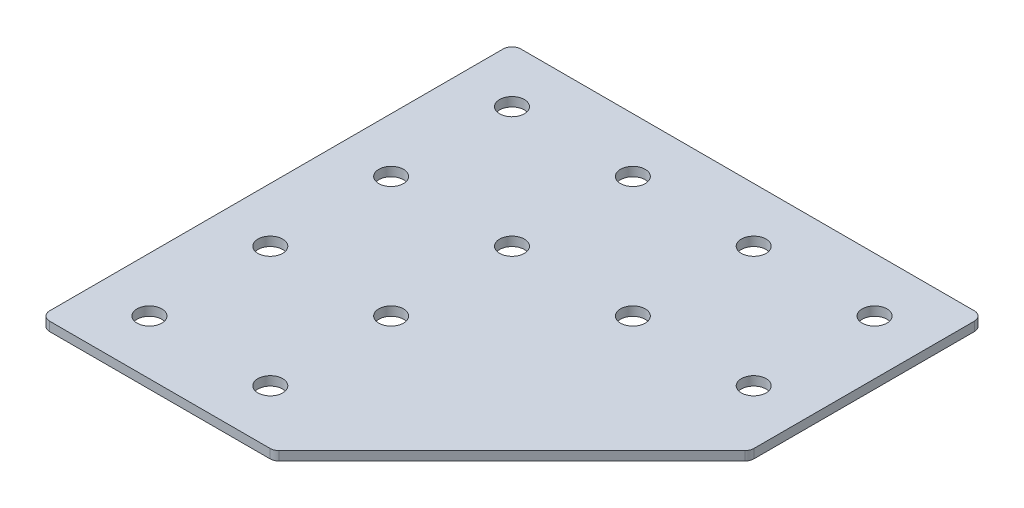
ISO-10303-21;
HEADER;
FILE_DESCRIPTION(('STEP AP214'),'2;1');
FILE_NAME('part.step','',(''),(''),'','','');
FILE_SCHEMA(('AUTOMOTIVE_DESIGN { 1 0 10303 214 1 1 1 1 }'));
ENDSEC;
DATA;
#1=APPLICATION_CONTEXT('core data for automotive mechanical design processes');
#2=APPLICATION_PROTOCOL_DEFINITION('international standard','automotive_design',2000,#1);
#3=PRODUCT_CONTEXT('',#1,'mechanical');
#4=PRODUCT('Part','Part','',(#3));
#5=PRODUCT_RELATED_PRODUCT_CATEGORY('part','',(#4));
#6=PRODUCT_DEFINITION_FORMATION('','',#4);
#7=PRODUCT_DEFINITION_CONTEXT('part definition',#1,'design');
#8=PRODUCT_DEFINITION('design','',#6,#7);
#9=PRODUCT_DEFINITION_SHAPE('','',#8);
#10=(LENGTH_UNIT() NAMED_UNIT(*) SI_UNIT(.MILLI.,.METRE.));
#11=(NAMED_UNIT(*) PLANE_ANGLE_UNIT() SI_UNIT($,.RADIAN.));
#12=(NAMED_UNIT(*) SI_UNIT($,.STERADIAN.) SOLID_ANGLE_UNIT());
#13=UNCERTAINTY_MEASURE_WITH_UNIT(LENGTH_MEASURE(1.E-05),#10,'distance_accuracy_value','');
#14=(GEOMETRIC_REPRESENTATION_CONTEXT(3) GLOBAL_UNCERTAINTY_ASSIGNED_CONTEXT((#13)) GLOBAL_UNIT_ASSIGNED_CONTEXT((#10,
#11,#12)) REPRESENTATION_CONTEXT('',''));
#15=CARTESIAN_POINT('',(0.,0.,0.));
#16=DIRECTION('',(0.,0.,1.));
#17=DIRECTION('',(1.,0.,0.));
#18=AXIS2_PLACEMENT_3D('',#15,#16,#17);
#19=CARTESIAN_POINT('',(-40.8616995423835,0.774709326684388,-41.412640110459));
#20=DIRECTION('',(0.,-1.,0.));
#21=DIRECTION('',(0.,0.,-1.));
#22=AXIS2_PLACEMENT_3D('',#19,#20,#21);
#23=PLANE('',#22);
#24=CARTESIAN_POINT('',(59.1383004576166,0.774709326684388,-21.412640110459));
#25=DIRECTION('',(0.,1.,0.));
#26=DIRECTION('',(0.,0.,1.));
#27=AXIS2_PLACEMENT_3D('',#24,#25,#26);
#28=CIRCLE('',#27,4.1);
#29=CARTESIAN_POINT('',(59.1383004576166,0.774709326684388,-17.312640110459));
#30=VERTEX_POINT('',#29);
#31=EDGE_CURVE('E275',#30,#30,#28,.T.);
#32=ORIENTED_EDGE('',*,*,#31,.T.);
#33=EDGE_LOOP('',(#32));
#34=FACE_BOUND('',#33,.T.);
#35=CARTESIAN_POINT('',(19.1383004576166,0.774709326684388,-21.412640110459));
#36=DIRECTION('',(0.,1.,0.));
#37=DIRECTION('',(0.,0.,1.));
#38=AXIS2_PLACEMENT_3D('',#35,#36,#37);
#39=CIRCLE('',#38,4.1);
#40=CARTESIAN_POINT('',(19.1383004576166,0.774709326684388,-17.312640110459));
#41=VERTEX_POINT('',#40);
#42=EDGE_CURVE('E283',#41,#41,#39,.T.);
#43=ORIENTED_EDGE('',*,*,#42,.T.);
#44=EDGE_LOOP('',(#43));
#45=FACE_BOUND('',#44,.T.);
#46=CARTESIAN_POINT('',(-20.8616995423835,0.774709326684388,58.587359889541));
#47=DIRECTION('',(0.,1.,0.));
#48=DIRECTION('',(0.,0.,1.));
#49=AXIS2_PLACEMENT_3D('',#46,#47,#48);
#50=CIRCLE('',#49,4.1);
#51=CARTESIAN_POINT('',(-20.8616995423835,0.774709326684388,62.687359889541));
#52=VERTEX_POINT('',#51);
#53=EDGE_CURVE('E289',#52,#52,#50,.T.);
#54=ORIENTED_EDGE('',*,*,#53,.T.);
#55=EDGE_LOOP('',(#54));
#56=FACE_BOUND('',#55,.T.);
#57=CARTESIAN_POINT('',(-60.8616995423835,0.774709326684388,58.587359889541));
#58=DIRECTION('',(0.,1.,0.));
#59=DIRECTION('',(0.,0.,1.));
#60=AXIS2_PLACEMENT_3D('',#57,#58,#59);
#61=CIRCLE('',#60,4.1);
#62=CARTESIAN_POINT('',(-60.8616995423835,0.774709326684388,62.687359889541));
#63=VERTEX_POINT('',#62);
#64=EDGE_CURVE('E295',#63,#63,#61,.T.);
#65=ORIENTED_EDGE('',*,*,#64,.T.);
#66=EDGE_LOOP('',(#65));
#67=FACE_BOUND('',#66,.T.);
#68=CARTESIAN_POINT('',(-20.8616995423835,0.774709326684388,18.587359889541));
#69=DIRECTION('',(0.,1.,0.));
#70=DIRECTION('',(0.,0.,1.));
#71=AXIS2_PLACEMENT_3D('',#68,#69,#70);
#72=CIRCLE('',#71,4.1);
#73=CARTESIAN_POINT('',(-20.8616995423835,0.774709326684388,22.687359889541));
#74=VERTEX_POINT('',#73);
#75=EDGE_CURVE('E301',#74,#74,#72,.T.);
#76=ORIENTED_EDGE('',*,*,#75,.T.);
#77=EDGE_LOOP('',(#76));
#78=FACE_BOUND('',#77,.T.);
#79=CARTESIAN_POINT('',(-60.8616995423835,0.774709326684388,18.587359889541));
#80=DIRECTION('',(0.,1.,0.));
#81=DIRECTION('',(0.,0.,1.));
#82=AXIS2_PLACEMENT_3D('',#79,#80,#81);
#83=CIRCLE('',#82,4.1);
#84=CARTESIAN_POINT('',(-60.8616995423835,0.774709326684388,22.687359889541));
#85=VERTEX_POINT('',#84);
#86=EDGE_CURVE('E307',#85,#85,#83,.T.);
#87=ORIENTED_EDGE('',*,*,#86,.T.);
#88=EDGE_LOOP('',(#87));
#89=FACE_BOUND('',#88,.T.);
#90=CARTESIAN_POINT('',(-20.8616995423835,0.774709326684388,-21.412640110459));
#91=DIRECTION('',(0.,1.,0.));
#92=DIRECTION('',(0.,0.,1.));
#93=AXIS2_PLACEMENT_3D('',#90,#91,#92);
#94=CIRCLE('',#93,4.1);
#95=CARTESIAN_POINT('',(-20.8616995423835,0.774709326684388,-17.312640110459));
#96=VERTEX_POINT('',#95);
#97=EDGE_CURVE('E313',#96,#96,#94,.T.);
#98=ORIENTED_EDGE('',*,*,#97,.T.);
#99=EDGE_LOOP('',(#98));
#100=FACE_BOUND('',#99,.T.);
#101=CARTESIAN_POINT('',(-60.8616995423835,0.774709326684388,-21.412640110459));
#102=DIRECTION('',(0.,1.,0.));
#103=DIRECTION('',(0.,0.,1.));
#104=AXIS2_PLACEMENT_3D('',#101,#102,#103);
#105=CIRCLE('',#104,4.1);
#106=CARTESIAN_POINT('',(-60.8616995423835,0.774709326684388,-17.312640110459));
#107=VERTEX_POINT('',#106);
#108=EDGE_CURVE('E319',#107,#107,#105,.T.);
#109=ORIENTED_EDGE('',*,*,#108,.T.);
#110=EDGE_LOOP('',(#109));
#111=FACE_BOUND('',#110,.T.);
#112=CARTESIAN_POINT('',(59.1383004576166,0.774709326684388,-61.412640110459));
#113=DIRECTION('',(0.,1.,0.));
#114=DIRECTION('',(0.,0.,1.));
#115=AXIS2_PLACEMENT_3D('',#112,#113,#114);
#116=CIRCLE('',#115,4.1);
#117=CARTESIAN_POINT('',(59.1383004576166,0.774709326684388,-57.312640110459));
#118=VERTEX_POINT('',#117);
#119=EDGE_CURVE('E325',#118,#118,#116,.T.);
#120=ORIENTED_EDGE('',*,*,#119,.T.);
#121=EDGE_LOOP('',(#120));
#122=FACE_BOUND('',#121,.T.);
#123=CARTESIAN_POINT('',(19.1383004576166,0.774709326684388,-61.412640110459));
#124=DIRECTION('',(0.,1.,0.));
#125=DIRECTION('',(0.,0.,1.));
#126=AXIS2_PLACEMENT_3D('',#123,#124,#125);
#127=CIRCLE('',#126,4.1);
#128=CARTESIAN_POINT('',(19.1383004576166,0.774709326684388,-57.312640110459));
#129=VERTEX_POINT('',#128);
#130=EDGE_CURVE('E331',#129,#129,#127,.T.);
#131=ORIENTED_EDGE('',*,*,#130,.T.);
#132=EDGE_LOOP('',(#131));
#133=FACE_BOUND('',#132,.T.);
#134=CARTESIAN_POINT('',(-20.8616995423835,0.774709326684388,-61.412640110459));
#135=DIRECTION('',(0.,1.,0.));
#136=DIRECTION('',(0.,0.,1.));
#137=AXIS2_PLACEMENT_3D('',#134,#135,#136);
#138=CIRCLE('',#137,4.1);
#139=CARTESIAN_POINT('',(-20.8616995423835,0.774709326684388,-57.312640110459));
#140=VERTEX_POINT('',#139);
#141=EDGE_CURVE('E337',#140,#140,#138,.T.);
#142=ORIENTED_EDGE('',*,*,#141,.T.);
#143=EDGE_LOOP('',(#142));
#144=FACE_BOUND('',#143,.T.);
#145=CARTESIAN_POINT('',(-60.8616995423835,0.774709326684388,-61.412640110459));
#146=DIRECTION('',(0.,1.,0.));
#147=DIRECTION('',(0.,0.,1.));
#148=AXIS2_PLACEMENT_3D('',#145,#146,#147);
#149=CIRCLE('',#148,4.1);
#150=CARTESIAN_POINT('',(-60.8616995423835,0.774709326684388,-57.312640110459));
#151=VERTEX_POINT('',#150);
#152=EDGE_CURVE('E175',#151,#151,#149,.T.);
#153=ORIENTED_EDGE('',*,*,#152,.T.);
#154=EDGE_LOOP('',(#153));
#155=FACE_BOUND('',#154,.T.);
#156=DIRECTION('',(1.,0.,0.));
#157=VECTOR('',#156,1.);
#158=CARTESIAN_POINT('',(-78.8616995423836,0.774709326684388,76.587359889541));
#159=LINE('',#158,#157);
#160=CARTESIAN_POINT('',(-75.8616995423836,0.774709326684388,76.587359889541));
#161=VERTEX_POINT('',#160);
#162=CARTESIAN_POINT('',(-2.93276735424881,0.774709326684388,76.5873598895409));
#163=VERTEX_POINT('',#162);
#164=EDGE_CURVE('E121',#161,#163,#159,.T.);
#165=ORIENTED_EDGE('',*,*,#164,.F.);
#166=CARTESIAN_POINT('',(-75.8616995423836,0.774709326684388,73.587359889541));
#167=DIRECTION('',(0.,-1.,0.));
#168=DIRECTION('',(0.,0.,-1.));
#169=AXIS2_PLACEMENT_3D('',#166,#167,#168);
#170=CIRCLE('',#169,3.);
#171=CARTESIAN_POINT('',(-78.8616995423836,0.774709326684388,73.587359889541));
#172=VERTEX_POINT('',#171);
#173=EDGE_CURVE('E145',#161,#172,#170,.T.);
#174=ORIENTED_EDGE('',*,*,#173,.T.);
#175=DIRECTION('',(0.,0.,1.));
#176=VECTOR('',#175,1.);
#177=CARTESIAN_POINT('',(-78.8616995423836,0.774709326684388,-79.412640110459));
#178=LINE('',#177,#176);
#179=CARTESIAN_POINT('',(-78.8616995423836,0.774709326684388,-76.412640110459));
#180=VERTEX_POINT('',#179);
#181=EDGE_CURVE('E162',#180,#172,#178,.T.);
#182=ORIENTED_EDGE('',*,*,#181,.F.);
#183=CARTESIAN_POINT('',(-75.8616995423836,0.774709326684388,-76.412640110459));
#184=DIRECTION('',(0.,-1.,0.));
#185=DIRECTION('',(0.,0.,-1.));
#186=AXIS2_PLACEMENT_3D('',#183,#184,#185);
#187=CIRCLE('',#186,3.);
#188=CARTESIAN_POINT('',(-75.8616995423836,0.774709326684388,-79.412640110459));
#189=VERTEX_POINT('',#188);
#190=EDGE_CURVE('E117',#180,#189,#187,.T.);
#191=ORIENTED_EDGE('',*,*,#190,.T.);
#192=DIRECTION('',(-1.,0.,0.));
#193=VECTOR('',#192,1.);
#194=CARTESIAN_POINT('',(77.1383004576164,0.774709326684388,-79.4126401104591));
#195=LINE('',#194,#193);
#196=CARTESIAN_POINT('',(74.1383004576164,0.774709326684388,-79.4126401104591));
#197=VERTEX_POINT('',#196);
#198=EDGE_CURVE('E160',#197,#189,#195,.T.);
#199=ORIENTED_EDGE('',*,*,#198,.F.);
#200=CARTESIAN_POINT('',(74.1383004576164,0.774709326684388,-76.4126401104591));
#201=DIRECTION('',(0.,-1.,0.));
#202=DIRECTION('',(0.,0.,-1.));
#203=AXIS2_PLACEMENT_3D('',#200,#201,#202);
#204=CIRCLE('',#203,3.);
#205=CARTESIAN_POINT('',(77.1383004576164,0.774709326684388,-76.4126401104591));
#206=VERTEX_POINT('',#205);
#207=EDGE_CURVE('E140',#197,#206,#204,.T.);
#208=ORIENTED_EDGE('',*,*,#207,.T.);
#209=DIRECTION('',(0.,0.,-1.));
#210=VECTOR('',#209,1.);
#211=CARTESIAN_POINT('',(77.1383004576164,0.774709326684388,-2.24106723520513));
#212=LINE('',#211,#210);
#213=CARTESIAN_POINT('',(77.1383004576164,0.774709326684388,-3.48370792232441));
#214=VERTEX_POINT('',#213);
#215=EDGE_CURVE('E163',#214,#206,#212,.T.);
#216=ORIENTED_EDGE('',*,*,#215,.F.);
#217=CARTESIAN_POINT('',(74.1383004576164,0.774709326684388,-3.48370792232441));
#218=DIRECTION('',(0.,-1.,0.));
#219=DIRECTION('',(0.,0.,-1.));
#220=AXIS2_PLACEMENT_3D('',#217,#218,#219);
#221=CIRCLE('',#220,3.);
#222=CARTESIAN_POINT('',(76.2596208011761,0.774709326684388,-1.36238757876479));
#223=VERTEX_POINT('',#222);
#224=EDGE_CURVE('E31',#214,#223,#221,.T.);
#225=ORIENTED_EDGE('',*,*,#224,.T.);
#226=DIRECTION('',(0.707106781186547,0.,-0.707106781186548));
#227=VECTOR('',#226,1.);
#228=CARTESIAN_POINT('',(-1.69012666712953,0.774709326684388,76.5873598895409));
#229=LINE('',#228,#227);
#230=CARTESIAN_POINT('',(-0.811447010689172,0.774709326684388,75.7086802331006));
#231=VERTEX_POINT('',#230);
#232=EDGE_CURVE('E118',#231,#223,#229,.T.);
#233=ORIENTED_EDGE('',*,*,#232,.F.);
#234=CARTESIAN_POINT('',(-2.93276735424881,0.774709326684388,73.5873598895409));
#235=DIRECTION('',(0.,-1.,0.));
#236=DIRECTION('',(0.,0.,-1.));
#237=AXIS2_PLACEMENT_3D('',#234,#235,#236);
#238=CIRCLE('',#237,3.);
#239=EDGE_CURVE('E143',#231,#163,#238,.T.);
#240=ORIENTED_EDGE('',*,*,#239,.T.);
#241=EDGE_LOOP('',(#165,#174,#182,#191,#199,#208,#216,#225,#233,#240));
#242=FACE_BOUND('',#241,.T.);
#243=ADVANCED_FACE('F16',(#34,#45,#56,#67,#78,#89,#100,#111,#122,#133,#144,#155,#242),#23,.T.);
#244=CARTESIAN_POINT('',(77.1383004576164,0.774709326684388,-2.24106723520513));
#245=DIRECTION('',(1.,0.,0.));
#246=DIRECTION('',(0.,0.,-1.));
#247=AXIS2_PLACEMENT_3D('',#244,#245,#246);
#248=PLANE('',#247);
#249=DIRECTION('',(0.,0.,-1.));
#250=VECTOR('',#249,1.);
#251=CARTESIAN_POINT('',(77.1383004576164,3.77470932668439,-2.24106723520513));
#252=LINE('',#251,#250);
#253=CARTESIAN_POINT('',(77.1383004576164,3.77470932668439,-3.48370792232441));
#254=VERTEX_POINT('',#253);
#255=CARTESIAN_POINT('',(77.1383004576164,3.77470932668439,-76.4126401104591));
#256=VERTEX_POINT('',#255);
#257=EDGE_CURVE('E172',#254,#256,#252,.T.);
#258=ORIENTED_EDGE('',*,*,#257,.F.);
#259=DIRECTION('',(0.,1.,0.));
#260=VECTOR('',#259,1.);
#261=CARTESIAN_POINT('',(77.1383004576164,0.774709326684388,-3.48370792232441));
#262=LINE('',#261,#260);
#263=EDGE_CURVE('E154',#254,#214,#262,.F.);
#264=ORIENTED_EDGE('',*,*,#263,.T.);
#265=ORIENTED_EDGE('',*,*,#215,.T.);
#266=DIRECTION('',(0.,1.,0.));
#267=VECTOR('',#266,1.);
#268=CARTESIAN_POINT('',(77.1383004576164,0.774709326684388,-76.4126401104591));
#269=LINE('',#268,#267);
#270=EDGE_CURVE('E151',#206,#256,#269,.T.);
#271=ORIENTED_EDGE('',*,*,#270,.T.);
#272=EDGE_LOOP('',(#258,#264,#265,#271));
#273=FACE_BOUND('',#272,.T.);
#274=ADVANCED_FACE('F206',(#273),#248,.T.);
#275=CARTESIAN_POINT('',(-1.69012666712953,0.774709326684388,76.5873598895409));
#276=DIRECTION('',(0.707106781186548,0.,0.707106781186547));
#277=DIRECTION('',(0.707106781186547,0.,-0.707106781186548));
#278=AXIS2_PLACEMENT_3D('',#275,#276,#277);
#279=PLANE('',#278);
#280=DIRECTION('',(0.707106781186547,0.,-0.707106781186548));
#281=VECTOR('',#280,1.);
#282=CARTESIAN_POINT('',(-1.69012666712953,3.77470932668439,76.5873598895409));
#283=LINE('',#282,#281);
#284=CARTESIAN_POINT('',(-0.811447010689172,3.77470932668439,75.7086802331006));
#285=VERTEX_POINT('',#284);
#286=CARTESIAN_POINT('',(76.2596208011761,3.77470932668439,-1.36238757876479));
#287=VERTEX_POINT('',#286);
#288=EDGE_CURVE('E124',#285,#287,#283,.T.);
#289=ORIENTED_EDGE('',*,*,#288,.F.);
#290=DIRECTION('',(0.,1.,0.));
#291=VECTOR('',#290,1.);
#292=CARTESIAN_POINT('',(-0.811447010689172,0.774709326684388,75.7086802331006));
#293=LINE('',#292,#291);
#294=EDGE_CURVE('E38',#285,#231,#293,.F.);
#295=ORIENTED_EDGE('',*,*,#294,.T.);
#296=ORIENTED_EDGE('',*,*,#232,.T.);
#297=DIRECTION('',(0.,1.,0.));
#298=VECTOR('',#297,1.);
#299=CARTESIAN_POINT('',(76.2596208011761,0.774709326684388,-1.36238757876479));
#300=LINE('',#299,#298);
#301=EDGE_CURVE('E147',#223,#287,#300,.T.);
#302=ORIENTED_EDGE('',*,*,#301,.T.);
#303=EDGE_LOOP('',(#289,#295,#296,#302));
#304=FACE_BOUND('',#303,.T.);
#305=ADVANCED_FACE('F180',(#304),#279,.T.);
#306=CARTESIAN_POINT('',(-78.8616995423836,0.774709326684388,76.587359889541));
#307=DIRECTION('',(0.,0.,1.));
#308=DIRECTION('',(1.,0.,0.));
#309=AXIS2_PLACEMENT_3D('',#306,#307,#308);
#310=PLANE('',#309);
#311=DIRECTION('',(1.,0.,0.));
#312=VECTOR('',#311,1.);
#313=CARTESIAN_POINT('',(-78.8616995423836,3.77470932668439,76.587359889541));
#314=LINE('',#313,#312);
#315=CARTESIAN_POINT('',(-75.8616995423836,3.77470932668439,76.587359889541));
#316=VERTEX_POINT('',#315);
#317=CARTESIAN_POINT('',(-2.93276735424881,3.77470932668439,76.5873598895409));
#318=VERTEX_POINT('',#317);
#319=EDGE_CURVE('E114',#316,#318,#314,.T.);
#320=ORIENTED_EDGE('',*,*,#319,.F.);
#321=DIRECTION('',(0.,1.,0.));
#322=VECTOR('',#321,1.);
#323=CARTESIAN_POINT('',(-75.8616995423836,0.774709326684388,76.587359889541));
#324=LINE('',#323,#322);
#325=EDGE_CURVE('E137',#316,#161,#324,.F.);
#326=ORIENTED_EDGE('',*,*,#325,.T.);
#327=ORIENTED_EDGE('',*,*,#164,.T.);
#328=DIRECTION('',(0.,1.,0.));
#329=VECTOR('',#328,1.);
#330=CARTESIAN_POINT('',(-2.93276735424881,0.774709326684388,76.5873598895409));
#331=LINE('',#330,#329);
#332=EDGE_CURVE('E134',#163,#318,#331,.T.);
#333=ORIENTED_EDGE('',*,*,#332,.T.);
#334=EDGE_LOOP('',(#320,#326,#327,#333));
#335=FACE_BOUND('',#334,.T.);
#336=ADVANCED_FACE('F189',(#335),#310,.T.);
#337=CARTESIAN_POINT('',(-78.8616995423836,0.774709326684388,-79.412640110459));
#338=DIRECTION('',(-1.,0.,0.));
#339=DIRECTION('',(0.,0.,1.));
#340=AXIS2_PLACEMENT_3D('',#337,#338,#339);
#341=PLANE('',#340);
#342=ORIENTED_EDGE('',*,*,#181,.T.);
#343=DIRECTION('',(0.,1.,0.));
#344=VECTOR('',#343,1.);
#345=CARTESIAN_POINT('',(-78.8616995423836,0.774709326684388,73.587359889541));
#346=LINE('',#345,#344);
#347=CARTESIAN_POINT('',(-78.8616995423836,3.77470932668439,73.587359889541));
#348=VERTEX_POINT('',#347);
#349=EDGE_CURVE('E105',#172,#348,#346,.T.);
#350=ORIENTED_EDGE('',*,*,#349,.T.);
#351=DIRECTION('',(0.,0.,1.));
#352=VECTOR('',#351,1.);
#353=CARTESIAN_POINT('',(-78.8616995423836,3.77470932668439,-79.412640110459));
#354=LINE('',#353,#352);
#355=CARTESIAN_POINT('',(-78.8616995423836,3.77470932668439,-76.412640110459));
#356=VERTEX_POINT('',#355);
#357=EDGE_CURVE('E97',#356,#348,#354,.T.);
#358=ORIENTED_EDGE('',*,*,#357,.F.);
#359=DIRECTION('',(0.,1.,0.));
#360=VECTOR('',#359,1.);
#361=CARTESIAN_POINT('',(-78.8616995423836,0.774709326684388,-76.412640110459));
#362=LINE('',#361,#360);
#363=EDGE_CURVE('E111',#356,#180,#362,.F.);
#364=ORIENTED_EDGE('',*,*,#363,.T.);
#365=EDGE_LOOP('',(#342,#350,#358,#364));
#366=FACE_BOUND('',#365,.T.);
#367=ADVANCED_FACE('F110',(#366),#341,.T.);
#368=CARTESIAN_POINT('',(77.1383004576164,0.774709326684388,-79.4126401104591));
#369=DIRECTION('',(0.,0.,-1.));
#370=DIRECTION('',(-1.,0.,0.));
#371=AXIS2_PLACEMENT_3D('',#368,#369,#370);
#372=PLANE('',#371);
#373=DIRECTION('',(-1.,0.,0.));
#374=VECTOR('',#373,1.);
#375=CARTESIAN_POINT('',(77.1383004576164,3.77470932668439,-79.4126401104591));
#376=LINE('',#375,#374);
#377=CARTESIAN_POINT('',(74.1383004576164,3.77470932668439,-79.4126401104591));
#378=VERTEX_POINT('',#377);
#379=CARTESIAN_POINT('',(-75.8616995423836,3.77470932668439,-79.412640110459));
#380=VERTEX_POINT('',#379);
#381=EDGE_CURVE('E99',#378,#380,#376,.T.);
#382=ORIENTED_EDGE('',*,*,#381,.F.);
#383=DIRECTION('',(0.,1.,0.));
#384=VECTOR('',#383,1.);
#385=CARTESIAN_POINT('',(74.1383004576164,0.774709326684388,-79.4126401104591));
#386=LINE('',#385,#384);
#387=EDGE_CURVE('E10',#378,#197,#386,.F.);
#388=ORIENTED_EDGE('',*,*,#387,.T.);
#389=ORIENTED_EDGE('',*,*,#198,.T.);
#390=DIRECTION('',(0.,1.,0.));
#391=VECTOR('',#390,1.);
#392=CARTESIAN_POINT('',(-75.8616995423836,0.774709326684388,-79.412640110459));
#393=LINE('',#392,#391);
#394=EDGE_CURVE('E24',#189,#380,#393,.T.);
#395=ORIENTED_EDGE('',*,*,#394,.T.);
#396=EDGE_LOOP('',(#382,#388,#389,#395));
#397=FACE_BOUND('',#396,.T.);
#398=ADVANCED_FACE('F157',(#397),#372,.T.);
#399=CARTESIAN_POINT('',(-40.8616995423835,3.77470932668439,-41.412640110459));
#400=DIRECTION('',(0.,-1.,0.));
#401=DIRECTION('',(0.,0.,-1.));
#402=AXIS2_PLACEMENT_3D('',#399,#400,#401);
#403=PLANE('',#402);
#404=CARTESIAN_POINT('',(59.1383004576166,3.77470932668439,-21.412640110459));
#405=DIRECTION('',(0.,1.,0.));
#406=DIRECTION('',(0.,0.,1.));
#407=AXIS2_PLACEMENT_3D('',#404,#405,#406);
#408=CIRCLE('',#407,4.1);
#409=CARTESIAN_POINT('',(59.1383004576166,3.77470932668439,-17.312640110459));
#410=VERTEX_POINT('',#409);
#411=EDGE_CURVE('E278',#410,#410,#408,.T.);
#412=ORIENTED_EDGE('',*,*,#411,.F.);
#413=EDGE_LOOP('',(#412));
#414=FACE_BOUND('',#413,.T.);
#415=CARTESIAN_POINT('',(19.1383004576166,3.77470932668439,-21.412640110459));
#416=DIRECTION('',(0.,1.,0.));
#417=DIRECTION('',(0.,0.,1.));
#418=AXIS2_PLACEMENT_3D('',#415,#416,#417);
#419=CIRCLE('',#418,4.1);
#420=CARTESIAN_POINT('',(19.1383004576166,3.77470932668439,-17.312640110459));
#421=VERTEX_POINT('',#420);
#422=EDGE_CURVE('E280',#421,#421,#419,.T.);
#423=ORIENTED_EDGE('',*,*,#422,.F.);
#424=EDGE_LOOP('',(#423));
#425=FACE_BOUND('',#424,.T.);
#426=CARTESIAN_POINT('',(-20.8616995423835,3.77470932668439,58.587359889541));
#427=DIRECTION('',(0.,1.,0.));
#428=DIRECTION('',(0.,0.,1.));
#429=AXIS2_PLACEMENT_3D('',#426,#427,#428);
#430=CIRCLE('',#429,4.1);
#431=CARTESIAN_POINT('',(-20.8616995423835,3.77470932668439,62.687359889541));
#432=VERTEX_POINT('',#431);
#433=EDGE_CURVE('E286',#432,#432,#430,.T.);
#434=ORIENTED_EDGE('',*,*,#433,.F.);
#435=EDGE_LOOP('',(#434));
#436=FACE_BOUND('',#435,.T.);
#437=CARTESIAN_POINT('',(-60.8616995423835,3.77470932668439,58.587359889541));
#438=DIRECTION('',(0.,1.,0.));
#439=DIRECTION('',(0.,0.,1.));
#440=AXIS2_PLACEMENT_3D('',#437,#438,#439);
#441=CIRCLE('',#440,4.1);
#442=CARTESIAN_POINT('',(-60.8616995423835,3.77470932668439,62.687359889541));
#443=VERTEX_POINT('',#442);
#444=EDGE_CURVE('E292',#443,#443,#441,.T.);
#445=ORIENTED_EDGE('',*,*,#444,.F.);
#446=EDGE_LOOP('',(#445));
#447=FACE_BOUND('',#446,.T.);
#448=CARTESIAN_POINT('',(-20.8616995423835,3.77470932668439,18.587359889541));
#449=DIRECTION('',(0.,1.,0.));
#450=DIRECTION('',(0.,0.,1.));
#451=AXIS2_PLACEMENT_3D('',#448,#449,#450);
#452=CIRCLE('',#451,4.1);
#453=CARTESIAN_POINT('',(-20.8616995423835,3.77470932668439,22.687359889541));
#454=VERTEX_POINT('',#453);
#455=EDGE_CURVE('E298',#454,#454,#452,.T.);
#456=ORIENTED_EDGE('',*,*,#455,.F.);
#457=EDGE_LOOP('',(#456));
#458=FACE_BOUND('',#457,.T.);
#459=CARTESIAN_POINT('',(-60.8616995423835,3.77470932668439,18.587359889541));
#460=DIRECTION('',(0.,1.,0.));
#461=DIRECTION('',(0.,0.,1.));
#462=AXIS2_PLACEMENT_3D('',#459,#460,#461);
#463=CIRCLE('',#462,4.1);
#464=CARTESIAN_POINT('',(-60.8616995423835,3.77470932668439,22.687359889541));
#465=VERTEX_POINT('',#464);
#466=EDGE_CURVE('E304',#465,#465,#463,.T.);
#467=ORIENTED_EDGE('',*,*,#466,.F.);
#468=EDGE_LOOP('',(#467));
#469=FACE_BOUND('',#468,.T.);
#470=CARTESIAN_POINT('',(-20.8616995423835,3.77470932668439,-21.412640110459));
#471=DIRECTION('',(0.,1.,0.));
#472=DIRECTION('',(0.,0.,1.));
#473=AXIS2_PLACEMENT_3D('',#470,#471,#472);
#474=CIRCLE('',#473,4.1);
#475=CARTESIAN_POINT('',(-20.8616995423835,3.77470932668439,-17.312640110459));
#476=VERTEX_POINT('',#475);
#477=EDGE_CURVE('E310',#476,#476,#474,.T.);
#478=ORIENTED_EDGE('',*,*,#477,.F.);
#479=EDGE_LOOP('',(#478));
#480=FACE_BOUND('',#479,.T.);
#481=CARTESIAN_POINT('',(-60.8616995423835,3.77470932668439,-21.412640110459));
#482=DIRECTION('',(0.,1.,0.));
#483=DIRECTION('',(0.,0.,1.));
#484=AXIS2_PLACEMENT_3D('',#481,#482,#483);
#485=CIRCLE('',#484,4.1);
#486=CARTESIAN_POINT('',(-60.8616995423835,3.77470932668439,-17.312640110459));
#487=VERTEX_POINT('',#486);
#488=EDGE_CURVE('E316',#487,#487,#485,.T.);
#489=ORIENTED_EDGE('',*,*,#488,.F.);
#490=EDGE_LOOP('',(#489));
#491=FACE_BOUND('',#490,.T.);
#492=CARTESIAN_POINT('',(59.1383004576166,3.77470932668439,-61.412640110459));
#493=DIRECTION('',(0.,1.,0.));
#494=DIRECTION('',(0.,0.,1.));
#495=AXIS2_PLACEMENT_3D('',#492,#493,#494);
#496=CIRCLE('',#495,4.1);
#497=CARTESIAN_POINT('',(59.1383004576166,3.77470932668439,-57.312640110459));
#498=VERTEX_POINT('',#497);
#499=EDGE_CURVE('E322',#498,#498,#496,.T.);
#500=ORIENTED_EDGE('',*,*,#499,.F.);
#501=EDGE_LOOP('',(#500));
#502=FACE_BOUND('',#501,.T.);
#503=CARTESIAN_POINT('',(19.1383004576166,3.77470932668439,-61.412640110459));
#504=DIRECTION('',(0.,1.,0.));
#505=DIRECTION('',(0.,0.,1.));
#506=AXIS2_PLACEMENT_3D('',#503,#504,#505);
#507=CIRCLE('',#506,4.1);
#508=CARTESIAN_POINT('',(19.1383004576166,3.77470932668439,-57.312640110459));
#509=VERTEX_POINT('',#508);
#510=EDGE_CURVE('E328',#509,#509,#507,.T.);
#511=ORIENTED_EDGE('',*,*,#510,.F.);
#512=EDGE_LOOP('',(#511));
#513=FACE_BOUND('',#512,.T.);
#514=CARTESIAN_POINT('',(-20.8616995423835,3.77470932668439,-61.412640110459));
#515=DIRECTION('',(0.,1.,0.));
#516=DIRECTION('',(0.,0.,1.));
#517=AXIS2_PLACEMENT_3D('',#514,#515,#516);
#518=CIRCLE('',#517,4.1);
#519=CARTESIAN_POINT('',(-20.8616995423835,3.77470932668439,-57.312640110459));
#520=VERTEX_POINT('',#519);
#521=EDGE_CURVE('E334',#520,#520,#518,.T.);
#522=ORIENTED_EDGE('',*,*,#521,.F.);
#523=EDGE_LOOP('',(#522));
#524=FACE_BOUND('',#523,.T.);
#525=CARTESIAN_POINT('',(-60.8616995423835,3.77470932668439,-61.412640110459));
#526=DIRECTION('',(0.,1.,0.));
#527=DIRECTION('',(0.,0.,1.));
#528=AXIS2_PLACEMENT_3D('',#525,#526,#527);
#529=CIRCLE('',#528,4.1);
#530=CARTESIAN_POINT('',(-60.8616995423835,3.77470932668439,-57.312640110459));
#531=VERTEX_POINT('',#530);
#532=EDGE_CURVE('E340',#531,#531,#529,.T.);
#533=ORIENTED_EDGE('',*,*,#532,.F.);
#534=EDGE_LOOP('',(#533));
#535=FACE_BOUND('',#534,.T.);
#536=ORIENTED_EDGE('',*,*,#357,.T.);
#537=CARTESIAN_POINT('',(-75.8616995423836,3.77470932668439,73.587359889541));
#538=DIRECTION('',(0.,-1.,0.));
#539=DIRECTION('',(0.,0.,-1.));
#540=AXIS2_PLACEMENT_3D('',#537,#538,#539);
#541=CIRCLE('',#540,3.);
#542=EDGE_CURVE('E132',#348,#316,#541,.F.);
#543=ORIENTED_EDGE('',*,*,#542,.T.);
#544=ORIENTED_EDGE('',*,*,#319,.T.);
#545=CARTESIAN_POINT('',(-2.93276735424881,3.77470932668439,73.5873598895409));
#546=DIRECTION('',(0.,-1.,0.));
#547=DIRECTION('',(0.,0.,-1.));
#548=AXIS2_PLACEMENT_3D('',#545,#546,#547);
#549=CIRCLE('',#548,3.);
#550=EDGE_CURVE('E130',#318,#285,#549,.F.);
#551=ORIENTED_EDGE('',*,*,#550,.T.);
#552=ORIENTED_EDGE('',*,*,#288,.T.);
#553=CARTESIAN_POINT('',(74.1383004576164,3.77470932668439,-3.48370792232441));
#554=DIRECTION('',(0.,-1.,0.));
#555=DIRECTION('',(0.,0.,-1.));
#556=AXIS2_PLACEMENT_3D('',#553,#554,#555);
#557=CIRCLE('',#556,3.);
#558=EDGE_CURVE('E128',#287,#254,#557,.F.);
#559=ORIENTED_EDGE('',*,*,#558,.T.);
#560=ORIENTED_EDGE('',*,*,#257,.T.);
#561=CARTESIAN_POINT('',(74.1383004576164,3.77470932668439,-76.4126401104591));
#562=DIRECTION('',(0.,-1.,0.));
#563=DIRECTION('',(0.,0.,-1.));
#564=AXIS2_PLACEMENT_3D('',#561,#562,#563);
#565=CIRCLE('',#564,3.);
#566=EDGE_CURVE('E104',#256,#378,#565,.F.);
#567=ORIENTED_EDGE('',*,*,#566,.T.);
#568=ORIENTED_EDGE('',*,*,#381,.T.);
#569=CARTESIAN_POINT('',(-75.8616995423836,3.77470932668439,-76.412640110459));
#570=DIRECTION('',(0.,-1.,0.));
#571=DIRECTION('',(0.,0.,-1.));
#572=AXIS2_PLACEMENT_3D('',#569,#570,#571);
#573=CIRCLE('',#572,3.);
#574=EDGE_CURVE('E94',#380,#356,#573,.F.);
#575=ORIENTED_EDGE('',*,*,#574,.T.);
#576=EDGE_LOOP('',(#536,#543,#544,#551,#552,#559,#560,#567,#568,#575));
#577=FACE_BOUND('',#576,.T.);
#578=ADVANCED_FACE('F96',(#414,#425,#436,#447,#458,#469,#480,#491,#502,#513,#524,#535,#577),
#403,.F.);
#579=CARTESIAN_POINT('',(-75.8616995423836,0.774709326684388,73.587359889541));
#580=DIRECTION('',(0.,1.,0.));
#581=DIRECTION('',(0.,0.,1.));
#582=AXIS2_PLACEMENT_3D('',#579,#580,#581);
#583=CYLINDRICAL_SURFACE('',#582,3.);
#584=ORIENTED_EDGE('',*,*,#173,.F.);
#585=ORIENTED_EDGE('',*,*,#325,.F.);
#586=ORIENTED_EDGE('',*,*,#542,.F.);
#587=ORIENTED_EDGE('',*,*,#349,.F.);
#588=EDGE_LOOP('',(#584,#585,#586,#587));
#589=FACE_BOUND('',#588,.T.);
#590=ADVANCED_FACE('F192',(#589),#583,.T.);
#591=CARTESIAN_POINT('',(-2.93276735424881,0.774709326684388,73.5873598895409));
#592=DIRECTION('',(0.,1.,0.));
#593=DIRECTION('',(0.,0.,1.));
#594=AXIS2_PLACEMENT_3D('',#591,#592,#593);
#595=CYLINDRICAL_SURFACE('',#594,3.);
#596=ORIENTED_EDGE('',*,*,#239,.F.);
#597=ORIENTED_EDGE('',*,*,#294,.F.);
#598=ORIENTED_EDGE('',*,*,#550,.F.);
#599=ORIENTED_EDGE('',*,*,#332,.F.);
#600=EDGE_LOOP('',(#596,#597,#598,#599));
#601=FACE_BOUND('',#600,.T.);
#602=ADVANCED_FACE('F184',(#601),#595,.T.);
#603=CARTESIAN_POINT('',(74.1383004576164,0.774709326684388,-3.48370792232441));
#604=DIRECTION('',(0.,1.,0.));
#605=DIRECTION('',(0.,0.,1.));
#606=AXIS2_PLACEMENT_3D('',#603,#604,#605);
#607=CYLINDRICAL_SURFACE('',#606,3.);
#608=ORIENTED_EDGE('',*,*,#224,.F.);
#609=ORIENTED_EDGE('',*,*,#263,.F.);
#610=ORIENTED_EDGE('',*,*,#558,.F.);
#611=ORIENTED_EDGE('',*,*,#301,.F.);
#612=EDGE_LOOP('',(#608,#609,#610,#611));
#613=FACE_BOUND('',#612,.T.);
#614=ADVANCED_FACE('F200',(#613),#607,.T.);
#615=CARTESIAN_POINT('',(74.1383004576164,0.774709326684388,-76.4126401104591));
#616=DIRECTION('',(0.,1.,0.));
#617=DIRECTION('',(0.,0.,1.));
#618=AXIS2_PLACEMENT_3D('',#615,#616,#617);
#619=CYLINDRICAL_SURFACE('',#618,3.);
#620=ORIENTED_EDGE('',*,*,#207,.F.);
#621=ORIENTED_EDGE('',*,*,#387,.F.);
#622=ORIENTED_EDGE('',*,*,#566,.F.);
#623=ORIENTED_EDGE('',*,*,#270,.F.);
#624=EDGE_LOOP('',(#620,#621,#622,#623));
#625=FACE_BOUND('',#624,.T.);
#626=ADVANCED_FACE('F451',(#625),#619,.T.);
#627=CARTESIAN_POINT('',(-75.8616995423836,0.774709326684388,-76.412640110459));
#628=DIRECTION('',(0.,1.,0.));
#629=DIRECTION('',(0.,0.,1.));
#630=AXIS2_PLACEMENT_3D('',#627,#628,#629);
#631=CYLINDRICAL_SURFACE('',#630,3.);
#632=ORIENTED_EDGE('',*,*,#190,.F.);
#633=ORIENTED_EDGE('',*,*,#363,.F.);
#634=ORIENTED_EDGE('',*,*,#574,.F.);
#635=ORIENTED_EDGE('',*,*,#394,.F.);
#636=EDGE_LOOP('',(#632,#633,#634,#635));
#637=FACE_BOUND('',#636,.T.);
#638=ADVANCED_FACE('F18',(#637),#631,.T.);
#639=CARTESIAN_POINT('',(-60.8616995423835,0.774709326684388,-61.412640110459));
#640=DIRECTION('',(0.,1.,0.));
#641=DIRECTION('',(0.,0.,1.));
#642=AXIS2_PLACEMENT_3D('',#639,#640,#641);
#643=CYLINDRICAL_SURFACE('',#642,4.1);
#644=ORIENTED_EDGE('',*,*,#152,.F.);
#645=EDGE_LOOP('',(#644));
#646=FACE_BOUND('',#645,.T.);
#647=ORIENTED_EDGE('',*,*,#532,.T.);
#648=EDGE_LOOP('',(#647));
#649=FACE_BOUND('',#648,.T.);
#650=ADVANCED_FACE('F224',(#646,#649),#643,.F.);
#651=CARTESIAN_POINT('',(-20.8616995423835,0.774709326684388,-61.412640110459));
#652=DIRECTION('',(0.,1.,0.));
#653=DIRECTION('',(0.,0.,1.));
#654=AXIS2_PLACEMENT_3D('',#651,#652,#653);
#655=CYLINDRICAL_SURFACE('',#654,4.1);
#656=ORIENTED_EDGE('',*,*,#141,.F.);
#657=EDGE_LOOP('',(#656));
#658=FACE_BOUND('',#657,.T.);
#659=ORIENTED_EDGE('',*,*,#521,.T.);
#660=EDGE_LOOP('',(#659));
#661=FACE_BOUND('',#660,.T.);
#662=ADVANCED_FACE('F227',(#658,#661),#655,.F.);
#663=CARTESIAN_POINT('',(19.1383004576166,0.774709326684388,-61.412640110459));
#664=DIRECTION('',(0.,1.,0.));
#665=DIRECTION('',(0.,0.,1.));
#666=AXIS2_PLACEMENT_3D('',#663,#664,#665);
#667=CYLINDRICAL_SURFACE('',#666,4.1);
#668=ORIENTED_EDGE('',*,*,#130,.F.);
#669=EDGE_LOOP('',(#668));
#670=FACE_BOUND('',#669,.T.);
#671=ORIENTED_EDGE('',*,*,#510,.T.);
#672=EDGE_LOOP('',(#671));
#673=FACE_BOUND('',#672,.T.);
#674=ADVANCED_FACE('F231',(#670,#673),#667,.F.);
#675=CARTESIAN_POINT('',(59.1383004576166,0.774709326684388,-61.412640110459));
#676=DIRECTION('',(0.,1.,0.));
#677=DIRECTION('',(0.,0.,1.));
#678=AXIS2_PLACEMENT_3D('',#675,#676,#677);
#679=CYLINDRICAL_SURFACE('',#678,4.1);
#680=ORIENTED_EDGE('',*,*,#119,.F.);
#681=EDGE_LOOP('',(#680));
#682=FACE_BOUND('',#681,.T.);
#683=ORIENTED_EDGE('',*,*,#499,.T.);
#684=EDGE_LOOP('',(#683));
#685=FACE_BOUND('',#684,.T.);
#686=ADVANCED_FACE('F235',(#682,#685),#679,.F.);
#687=CARTESIAN_POINT('',(-60.8616995423835,0.774709326684388,-21.412640110459));
#688=DIRECTION('',(0.,1.,0.));
#689=DIRECTION('',(0.,0.,1.));
#690=AXIS2_PLACEMENT_3D('',#687,#688,#689);
#691=CYLINDRICAL_SURFACE('',#690,4.1);
#692=ORIENTED_EDGE('',*,*,#108,.F.);
#693=EDGE_LOOP('',(#692));
#694=FACE_BOUND('',#693,.T.);
#695=ORIENTED_EDGE('',*,*,#488,.T.);
#696=EDGE_LOOP('',(#695));
#697=FACE_BOUND('',#696,.T.);
#698=ADVANCED_FACE('F239',(#694,#697),#691,.F.);
#699=CARTESIAN_POINT('',(-20.8616995423835,0.774709326684388,-21.412640110459));
#700=DIRECTION('',(0.,1.,0.));
#701=DIRECTION('',(0.,0.,1.));
#702=AXIS2_PLACEMENT_3D('',#699,#700,#701);
#703=CYLINDRICAL_SURFACE('',#702,4.1);
#704=ORIENTED_EDGE('',*,*,#97,.F.);
#705=EDGE_LOOP('',(#704));
#706=FACE_BOUND('',#705,.T.);
#707=ORIENTED_EDGE('',*,*,#477,.T.);
#708=EDGE_LOOP('',(#707));
#709=FACE_BOUND('',#708,.T.);
#710=ADVANCED_FACE('F243',(#706,#709),#703,.F.);
#711=CARTESIAN_POINT('',(-60.8616995423835,0.774709326684388,18.587359889541));
#712=DIRECTION('',(0.,1.,0.));
#713=DIRECTION('',(0.,0.,1.));
#714=AXIS2_PLACEMENT_3D('',#711,#712,#713);
#715=CYLINDRICAL_SURFACE('',#714,4.1);
#716=ORIENTED_EDGE('',*,*,#86,.F.);
#717=EDGE_LOOP('',(#716));
#718=FACE_BOUND('',#717,.T.);
#719=ORIENTED_EDGE('',*,*,#466,.T.);
#720=EDGE_LOOP('',(#719));
#721=FACE_BOUND('',#720,.T.);
#722=ADVANCED_FACE('F247',(#718,#721),#715,.F.);
#723=CARTESIAN_POINT('',(-20.8616995423835,0.774709326684388,18.587359889541));
#724=DIRECTION('',(0.,1.,0.));
#725=DIRECTION('',(0.,0.,1.));
#726=AXIS2_PLACEMENT_3D('',#723,#724,#725);
#727=CYLINDRICAL_SURFACE('',#726,4.1);
#728=ORIENTED_EDGE('',*,*,#75,.F.);
#729=EDGE_LOOP('',(#728));
#730=FACE_BOUND('',#729,.T.);
#731=ORIENTED_EDGE('',*,*,#455,.T.);
#732=EDGE_LOOP('',(#731));
#733=FACE_BOUND('',#732,.T.);
#734=ADVANCED_FACE('F251',(#730,#733),#727,.F.);
#735=CARTESIAN_POINT('',(-60.8616995423835,0.774709326684388,58.587359889541));
#736=DIRECTION('',(0.,1.,0.));
#737=DIRECTION('',(0.,0.,1.));
#738=AXIS2_PLACEMENT_3D('',#735,#736,#737);
#739=CYLINDRICAL_SURFACE('',#738,4.1);
#740=ORIENTED_EDGE('',*,*,#64,.F.);
#741=EDGE_LOOP('',(#740));
#742=FACE_BOUND('',#741,.T.);
#743=ORIENTED_EDGE('',*,*,#444,.T.);
#744=EDGE_LOOP('',(#743));
#745=FACE_BOUND('',#744,.T.);
#746=ADVANCED_FACE('F255',(#742,#745),#739,.F.);
#747=CARTESIAN_POINT('',(-20.8616995423835,0.774709326684388,58.587359889541));
#748=DIRECTION('',(0.,1.,0.));
#749=DIRECTION('',(0.,0.,1.));
#750=AXIS2_PLACEMENT_3D('',#747,#748,#749);
#751=CYLINDRICAL_SURFACE('',#750,4.1);
#752=ORIENTED_EDGE('',*,*,#53,.F.);
#753=EDGE_LOOP('',(#752));
#754=FACE_BOUND('',#753,.T.);
#755=ORIENTED_EDGE('',*,*,#433,.T.);
#756=EDGE_LOOP('',(#755));
#757=FACE_BOUND('',#756,.T.);
#758=ADVANCED_FACE('F259',(#754,#757),#751,.F.);
#759=CARTESIAN_POINT('',(19.1383004576166,0.774709326684388,-21.412640110459));
#760=DIRECTION('',(0.,1.,0.));
#761=DIRECTION('',(0.,0.,1.));
#762=AXIS2_PLACEMENT_3D('',#759,#760,#761);
#763=CYLINDRICAL_SURFACE('',#762,4.1);
#764=ORIENTED_EDGE('',*,*,#42,.F.);
#765=EDGE_LOOP('',(#764));
#766=FACE_BOUND('',#765,.T.);
#767=ORIENTED_EDGE('',*,*,#422,.T.);
#768=EDGE_LOOP('',(#767));
#769=FACE_BOUND('',#768,.T.);
#770=ADVANCED_FACE('F263',(#766,#769),#763,.F.);
#771=CARTESIAN_POINT('',(59.1383004576166,0.774709326684388,-21.412640110459));
#772=DIRECTION('',(0.,1.,0.));
#773=DIRECTION('',(0.,0.,1.));
#774=AXIS2_PLACEMENT_3D('',#771,#772,#773);
#775=CYLINDRICAL_SURFACE('',#774,4.1);
#776=ORIENTED_EDGE('',*,*,#31,.F.);
#777=EDGE_LOOP('',(#776));
#778=FACE_BOUND('',#777,.T.);
#779=ORIENTED_EDGE('',*,*,#411,.T.);
#780=EDGE_LOOP('',(#779));
#781=FACE_BOUND('',#780,.T.);
#782=ADVANCED_FACE('F267',(#778,#781),#775,.F.);
#783=CLOSED_SHELL('',(#243,#274,#305,#336,#367,#398,#578,#590,#602,#614,#626,#638,#650,#662,
#674,#686,#698,#710,#722,#734,#746,#758,#770,#782));
#784=MANIFOLD_SOLID_BREP('B1',#783);
#785=ADVANCED_BREP_SHAPE_REPRESENTATION('',(#18,#784),#14);
#786=SHAPE_DEFINITION_REPRESENTATION(#9,#785);
ENDSEC;
END-ISO-10303-21;
